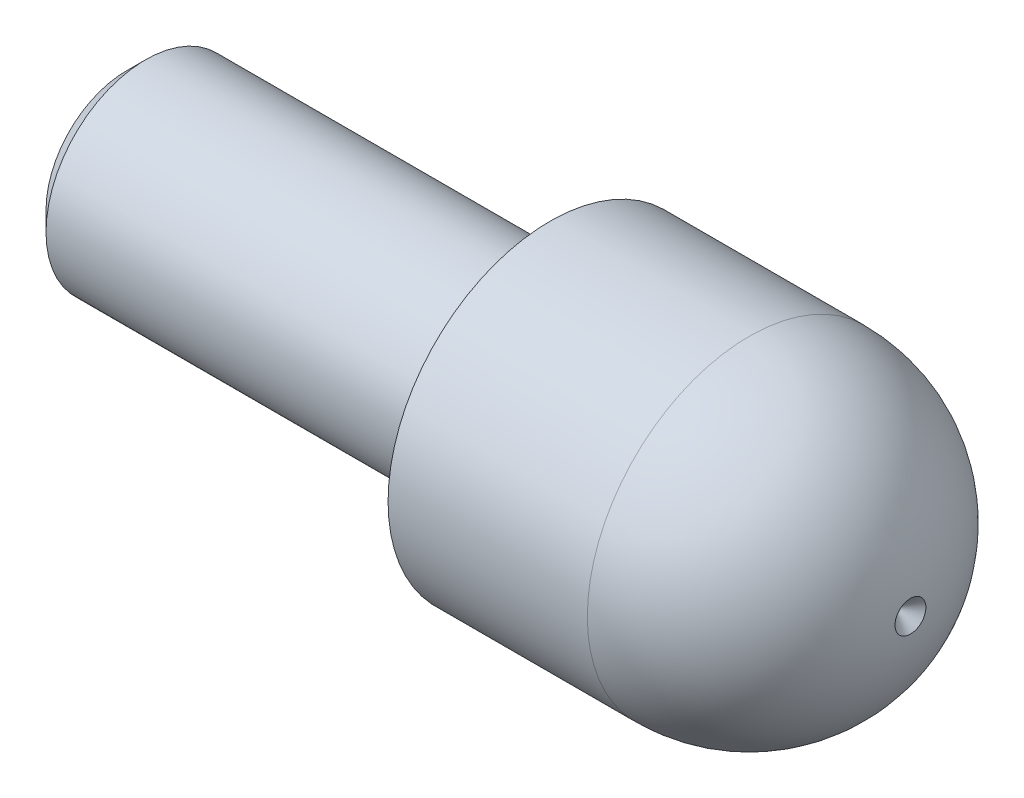
ISO-10303-21;
HEADER;
FILE_DESCRIPTION(('STEP AP214'),'2;1');
FILE_NAME('part.step','',(''),(''),'','','');
FILE_SCHEMA(('AUTOMOTIVE_DESIGN { 1 0 10303 214 1 1 1 1 }'));
ENDSEC;
DATA;
#1=APPLICATION_CONTEXT('core data for automotive mechanical design processes');
#2=APPLICATION_PROTOCOL_DEFINITION('international standard','automotive_design',2000,#1);
#3=PRODUCT_CONTEXT('',#1,'mechanical');
#4=PRODUCT('Part','Part','',(#3));
#5=PRODUCT_RELATED_PRODUCT_CATEGORY('part','',(#4));
#6=PRODUCT_DEFINITION_FORMATION('','',#4);
#7=PRODUCT_DEFINITION_CONTEXT('part definition',#1,'design');
#8=PRODUCT_DEFINITION('design','',#6,#7);
#9=PRODUCT_DEFINITION_SHAPE('','',#8);
#10=(LENGTH_UNIT() NAMED_UNIT(*) SI_UNIT(.MILLI.,.METRE.));
#11=(NAMED_UNIT(*) PLANE_ANGLE_UNIT() SI_UNIT($,.RADIAN.));
#12=(NAMED_UNIT(*) SI_UNIT($,.STERADIAN.) SOLID_ANGLE_UNIT());
#13=UNCERTAINTY_MEASURE_WITH_UNIT(LENGTH_MEASURE(1.E-05),#10,'distance_accuracy_value','');
#14=(GEOMETRIC_REPRESENTATION_CONTEXT(3) GLOBAL_UNCERTAINTY_ASSIGNED_CONTEXT((#13)) GLOBAL_UNIT_ASSIGNED_CONTEXT((#10,
#11,#12)) REPRESENTATION_CONTEXT('',''));
#15=CARTESIAN_POINT('',(0.,0.,0.));
#16=DIRECTION('',(0.,0.,1.));
#17=DIRECTION('',(1.,0.,0.));
#18=AXIS2_PLACEMENT_3D('',#15,#16,#17);
#19=CARTESIAN_POINT('',(0.,0.,0.));
#20=DIRECTION('',(1.,0.,0.));
#21=DIRECTION('',(0.,0.,-1.));
#22=AXIS2_PLACEMENT_3D('',#19,#20,#21);
#23=PLANE('',#22);
#24=CARTESIAN_POINT('',(0.,0.,0.));
#25=DIRECTION('',(-1.,0.,0.));
#26=DIRECTION('',(0.,0.,1.));
#27=AXIS2_PLACEMENT_3D('',#24,#25,#26);
#28=CIRCLE('',#27,4.);
#29=CARTESIAN_POINT('',(0.,0.,4.));
#30=VERTEX_POINT('',#29);
#31=EDGE_CURVE('E104',#30,#30,#28,.T.);
#32=ORIENTED_EDGE('',*,*,#31,.F.);
#33=EDGE_LOOP('',(#32));
#34=FACE_BOUND('',#33,.T.);
#35=CARTESIAN_POINT('',(0.,0.,0.));
#36=DIRECTION('',(-1.,0.,0.));
#37=DIRECTION('',(0.,0.,1.));
#38=AXIS2_PLACEMENT_3D('',#35,#36,#37);
#39=CIRCLE('',#38,6.5);
#40=CARTESIAN_POINT('',(0.,0.,6.5));
#41=VERTEX_POINT('',#40);
#42=EDGE_CURVE('E88',#41,#41,#39,.T.);
#43=ORIENTED_EDGE('',*,*,#42,.T.);
#44=EDGE_LOOP('',(#43));
#45=FACE_BOUND('',#44,.T.);
#46=ADVANCED_FACE('F34',(#34,#45),#23,.F.);
#47=CARTESIAN_POINT('',(50.,0.,0.));
#48=DIRECTION('',(-1.,0.,0.));
#49=DIRECTION('',(0.,0.,1.));
#50=AXIS2_PLACEMENT_3D('',#47,#48,#49);
#51=CYLINDRICAL_SURFACE('',#50,6.5);
#52=ORIENTED_EDGE('',*,*,#42,.F.);
#53=EDGE_LOOP('',(#52));
#54=FACE_BOUND('',#53,.T.);
#55=CARTESIAN_POINT('',(8.,0.,0.));
#56=DIRECTION('',(-1.,0.,0.));
#57=DIRECTION('',(0.,0.,1.));
#58=AXIS2_PLACEMENT_3D('',#55,#56,#57);
#59=CIRCLE('',#58,6.5);
#60=CARTESIAN_POINT('',(8.,0.,6.5));
#61=VERTEX_POINT('',#60);
#62=EDGE_CURVE('E90',#61,#61,#59,.T.);
#63=ORIENTED_EDGE('',*,*,#62,.T.);
#64=EDGE_LOOP('',(#63));
#65=FACE_BOUND('',#64,.T.);
#66=ADVANCED_FACE('F57',(#54,#65),#51,.T.);
#67=CARTESIAN_POINT('',(7.99999999999895,-1.5855372570428E-12,0.));
#68=DIRECTION('',(-1.,0.,0.));
#69=DIRECTION('',(0.,1.,0.));
#70=AXIS2_PLACEMENT_3D('',#67,#68,#69);
#71=SPHERICAL_SURFACE('',#70,6.50000000000159);
#72=ORIENTED_EDGE('',*,*,#62,.F.);
#73=EDGE_LOOP('',(#72));
#74=FACE_BOUND('',#73,.T.);
#75=CARTESIAN_POINT('',(14.470331437257,0.,0.));
#76=DIRECTION('',(-1.,0.,0.));
#77=DIRECTION('',(0.,0.,1.));
#78=AXIS2_PLACEMENT_3D('',#75,#76,#77);
#79=CIRCLE('',#78,0.62033143725661);
#80=CARTESIAN_POINT('',(14.470331437257,0.,0.62033143725661));
#81=VERTEX_POINT('',#80);
#82=EDGE_CURVE('E95',#81,#81,#79,.T.);
#83=ORIENTED_EDGE('',*,*,#82,.T.);
#84=EDGE_LOOP('',(#83));
#85=FACE_BOUND('',#84,.T.);
#86=ADVANCED_FACE('F47',(#74,#85),#71,.T.);
#87=CARTESIAN_POINT('',(13.85,0.,0.));
#88=DIRECTION('',(1.,0.,0.));
#89=DIRECTION('',(0.,0.,-1.));
#90=AXIS2_PLACEMENT_3D('',#87,#88,#89);
#91=CONICAL_SURFACE('',#90,0.,0.785398163397136);
#92=ORIENTED_EDGE('',*,*,#82,.F.);
#93=EDGE_LOOP('',(#92));
#94=FACE_BOUND('',#93,.T.);
#95=CARTESIAN_POINT('',(13.85,0.,0.));
#96=VERTEX_POINT('',#95);
#97=VERTEX_LOOP('',#96);
#98=FACE_BOUND('',#97,.T.);
#99=ADVANCED_FACE('F44',(#94,#98),#91,.F.);
#100=CARTESIAN_POINT('',(-0.826794919243149,0.,0.));
#101=DIRECTION('',(-1.,0.,0.));
#102=DIRECTION('',(0.,0.,1.));
#103=AXIS2_PLACEMENT_3D('',#100,#101,#102);
#104=TOROIDAL_SURFACE('',#103,4.09999999999994,0.199999999999937);
#105=CARTESIAN_POINT('',(-0.82679491924312,0.,0.));
#106=DIRECTION('',(-1.,0.,0.));
#107=DIRECTION('',(0.,0.,1.));
#108=AXIS2_PLACEMENT_3D('',#105,#106,#107);
#109=CIRCLE('',#108,3.9);
#110=CARTESIAN_POINT('',(-0.82679491924312,0.,3.9));
#111=VERTEX_POINT('',#110);
#112=EDGE_CURVE('E98',#111,#111,#109,.T.);
#113=ORIENTED_EDGE('',*,*,#112,.T.);
#114=EDGE_LOOP('',(#113));
#115=FACE_BOUND('',#114,.T.);
#116=CARTESIAN_POINT('',(-1.,0.,0.));
#117=DIRECTION('',(-1.,0.,0.));
#118=DIRECTION('',(0.,0.,1.));
#119=AXIS2_PLACEMENT_3D('',#116,#117,#118);
#120=CIRCLE('',#119,4.);
#121=CARTESIAN_POINT('',(-1.,0.,4.));
#122=VERTEX_POINT('',#121);
#123=EDGE_CURVE('E107',#122,#122,#120,.T.);
#124=ORIENTED_EDGE('',*,*,#123,.F.);
#125=EDGE_LOOP('',(#124));
#126=FACE_BOUND('',#125,.T.);
#127=ADVANCED_FACE('F46',(#115,#126),#104,.F.);
#128=CARTESIAN_POINT('',(0.,0.,0.));
#129=DIRECTION('',(-1.,0.,0.));
#130=DIRECTION('',(0.,0.,1.));
#131=AXIS2_PLACEMENT_3D('',#128,#129,#130);
#132=CYLINDRICAL_SURFACE('',#131,3.9);
#133=CARTESIAN_POINT('',(-0.17320508075689,0.,0.));
#134=DIRECTION('',(-1.,0.,0.));
#135=DIRECTION('',(0.,0.,1.));
#136=AXIS2_PLACEMENT_3D('',#133,#134,#135);
#137=CIRCLE('',#136,3.9);
#138=CARTESIAN_POINT('',(-0.17320508075689,0.,3.9));
#139=VERTEX_POINT('',#138);
#140=EDGE_CURVE('E101',#139,#139,#137,.T.);
#141=ORIENTED_EDGE('',*,*,#140,.T.);
#142=EDGE_LOOP('',(#141));
#143=FACE_BOUND('',#142,.T.);
#144=ORIENTED_EDGE('',*,*,#112,.F.);
#145=EDGE_LOOP('',(#144));
#146=FACE_BOUND('',#145,.T.);
#147=ADVANCED_FACE('F54',(#143,#146),#132,.T.);
#148=CARTESIAN_POINT('',(-0.173205080756848,0.,0.));
#149=DIRECTION('',(-1.,0.,0.));
#150=DIRECTION('',(0.,0.,1.));
#151=AXIS2_PLACEMENT_3D('',#148,#149,#150);
#152=TOROIDAL_SURFACE('',#151,4.09999999999993,0.199999999999932);
#153=ORIENTED_EDGE('',*,*,#31,.T.);
#154=EDGE_LOOP('',(#153));
#155=FACE_BOUND('',#154,.T.);
#156=ORIENTED_EDGE('',*,*,#140,.F.);
#157=EDGE_LOOP('',(#156));
#158=FACE_BOUND('',#157,.T.);
#159=ADVANCED_FACE('F82',(#155,#158),#152,.F.);
#160=CARTESIAN_POINT('',(-17.,0.,0.));
#161=DIRECTION('',(1.,0.,0.));
#162=DIRECTION('',(0.,0.,-1.));
#163=AXIS2_PLACEMENT_3D('',#160,#161,#162);
#164=PLANE('',#163);
#165=CARTESIAN_POINT('',(-17.,0.,0.));
#166=DIRECTION('',(-1.,0.,0.));
#167=DIRECTION('',(0.,0.,1.));
#168=AXIS2_PLACEMENT_3D('',#165,#166,#167);
#169=CIRCLE('',#168,3.233);
#170=CARTESIAN_POINT('',(-17.,0.,3.233));
#171=VERTEX_POINT('',#170);
#172=EDGE_CURVE('E11',#171,#171,#169,.T.);
#173=ORIENTED_EDGE('',*,*,#172,.T.);
#174=EDGE_LOOP('',(#173));
#175=FACE_BOUND('',#174,.T.);
#176=ADVANCED_FACE('F36',(#175),#164,.F.);
#177=CARTESIAN_POINT('',(-16.233,0.,0.));
#178=DIRECTION('',(1.,0.,0.));
#179=DIRECTION('',(0.,0.,-1.));
#180=AXIS2_PLACEMENT_3D('',#177,#178,#179);
#181=CONICAL_SURFACE('',#180,4.,0.785398163397448);
#182=ORIENTED_EDGE('',*,*,#172,.F.);
#183=EDGE_LOOP('',(#182));
#184=FACE_BOUND('',#183,.T.);
#185=CARTESIAN_POINT('',(-16.233,0.,0.));
#186=DIRECTION('',(-1.,0.,0.));
#187=DIRECTION('',(0.,0.,1.));
#188=AXIS2_PLACEMENT_3D('',#185,#186,#187);
#189=CIRCLE('',#188,4.);
#190=CARTESIAN_POINT('',(-16.233,0.,4.));
#191=VERTEX_POINT('',#190);
#192=EDGE_CURVE('E41',#191,#191,#189,.T.);
#193=ORIENTED_EDGE('',*,*,#192,.T.);
#194=EDGE_LOOP('',(#193));
#195=FACE_BOUND('',#194,.T.);
#196=ADVANCED_FACE('F74',(#184,#195),#181,.T.);
#197=CARTESIAN_POINT('',(0.,0.,0.));
#198=DIRECTION('',(-1.,0.,0.));
#199=DIRECTION('',(0.,0.,1.));
#200=AXIS2_PLACEMENT_3D('',#197,#198,#199);
#201=CYLINDRICAL_SURFACE('',#200,4.);
#202=ORIENTED_EDGE('',*,*,#192,.F.);
#203=EDGE_LOOP('',(#202));
#204=FACE_BOUND('',#203,.T.);
#205=ORIENTED_EDGE('',*,*,#123,.T.);
#206=EDGE_LOOP('',(#205));
#207=FACE_BOUND('',#206,.T.);
#208=ADVANCED_FACE('F72',(#204,#207),#201,.T.);
#209=CLOSED_SHELL('',(#46,#66,#86,#99,#127,#147,#159,#176,#196,#208));
#210=MANIFOLD_SOLID_BREP('B2',#209);
#211=ADVANCED_BREP_SHAPE_REPRESENTATION('',(#18,#210),#14);
#212=SHAPE_DEFINITION_REPRESENTATION(#9,#211);
ENDSEC;
END-ISO-10303-21;
